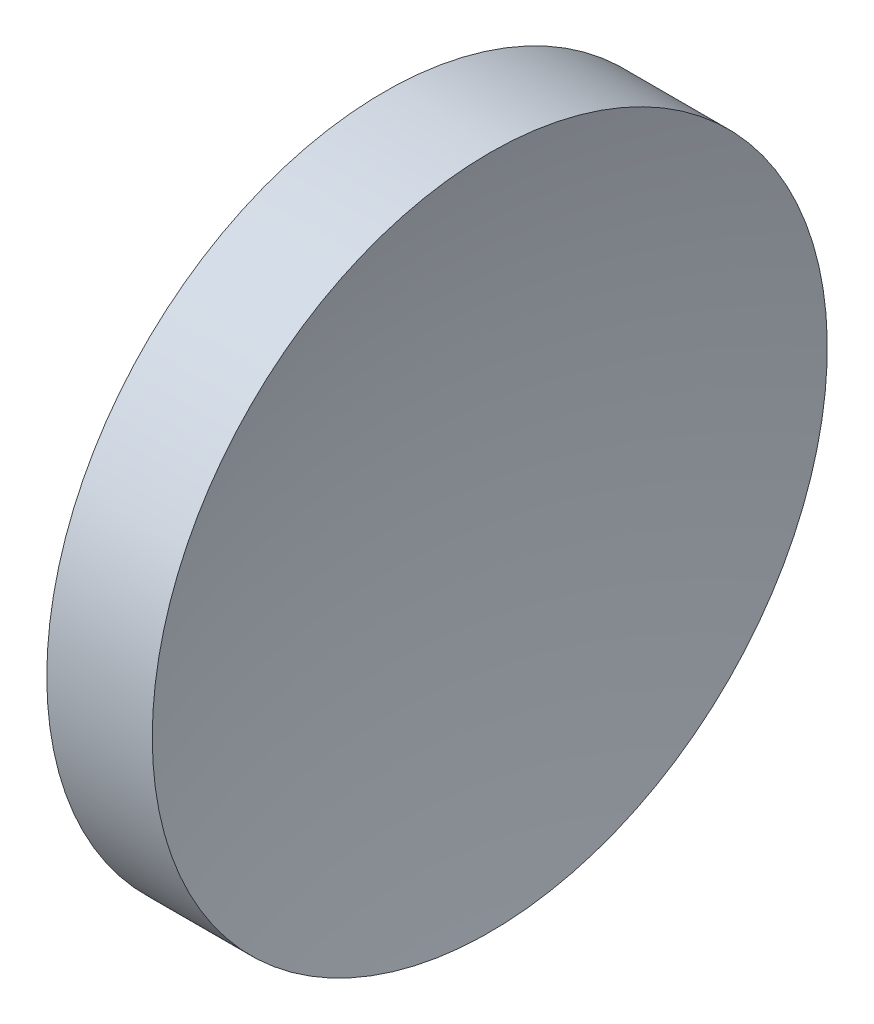
ISO-10303-21;
HEADER;
FILE_DESCRIPTION(('STEP AP214'),'2;1');
FILE_NAME('part.step','',(''),(''),'','','');
FILE_SCHEMA(('AUTOMOTIVE_DESIGN { 1 0 10303 214 1 1 1 1 }'));
ENDSEC;
DATA;
#1=APPLICATION_CONTEXT('core data for automotive mechanical design processes');
#2=APPLICATION_PROTOCOL_DEFINITION('international standard','automotive_design',2000,#1);
#3=PRODUCT_CONTEXT('',#1,'mechanical');
#4=PRODUCT('Part','Part','',(#3));
#5=PRODUCT_RELATED_PRODUCT_CATEGORY('part','',(#4));
#6=PRODUCT_DEFINITION_FORMATION('','',#4);
#7=PRODUCT_DEFINITION_CONTEXT('part definition',#1,'design');
#8=PRODUCT_DEFINITION('design','',#6,#7);
#9=PRODUCT_DEFINITION_SHAPE('','',#8);
#10=(LENGTH_UNIT() NAMED_UNIT(*) SI_UNIT(.MILLI.,.METRE.));
#11=(NAMED_UNIT(*) PLANE_ANGLE_UNIT() SI_UNIT($,.RADIAN.));
#12=(NAMED_UNIT(*) SI_UNIT($,.STERADIAN.) SOLID_ANGLE_UNIT());
#13=UNCERTAINTY_MEASURE_WITH_UNIT(LENGTH_MEASURE(1.E-05),#10,'distance_accuracy_value','');
#14=(GEOMETRIC_REPRESENTATION_CONTEXT(3) GLOBAL_UNCERTAINTY_ASSIGNED_CONTEXT((#13)) GLOBAL_UNIT_ASSIGNED_CONTEXT((#10,
#11,#12)) REPRESENTATION_CONTEXT('',''));
#15=CARTESIAN_POINT('',(0.,0.,0.));
#16=DIRECTION('',(0.,0.,1.));
#17=DIRECTION('',(1.,0.,0.));
#18=AXIS2_PLACEMENT_3D('',#15,#16,#17);
#19=CARTESIAN_POINT('',(78.319152657616,26.089041149195,0.));
#20=DIRECTION('',(-1.,0.,0.));
#21=DIRECTION('',(0.,1.,0.));
#22=AXIS2_PLACEMENT_3D('',#19,#20,#21);
#23=SPHERICAL_SURFACE('',#22,32.5);
#24=CARTESIAN_POINT('',(46.819152657616,26.089041149195,0.));
#25=DIRECTION('',(-1.,0.,0.));
#26=DIRECTION('',(0.,0.,1.));
#27=AXIS2_PLACEMENT_3D('',#24,#25,#26);
#28=CIRCLE('',#27,8.);
#29=CARTESIAN_POINT('',(46.819152657616,26.089041149195,8.));
#30=VERTEX_POINT('',#29);
#31=EDGE_CURVE('E10',#30,#30,#28,.T.);
#32=ORIENTED_EDGE('',*,*,#31,.F.);
#33=EDGE_LOOP('',(#32));
#34=FACE_BOUND('',#33,.T.);
#35=ADVANCED_FACE('F33',(#34),#23,.F.);
#36=CARTESIAN_POINT('',(42.4498611141368,26.089041149195,0.));
#37=DIRECTION('',(-1.,0.,0.));
#38=DIRECTION('',(0.,0.,1.));
#39=AXIS2_PLACEMENT_3D('',#36,#37,#38);
#40=CYLINDRICAL_SURFACE('',#39,8.);
#41=CARTESIAN_POINT('',(44.3191526931544,26.089041149195,0.));
#42=DIRECTION('',(-1.,0.,0.));
#43=DIRECTION('',(0.,0.,1.));
#44=AXIS2_PLACEMENT_3D('',#41,#42,#43);
#45=CIRCLE('',#44,8.);
#46=CARTESIAN_POINT('',(44.3191526931544,26.089041149195,8.));
#47=VERTEX_POINT('',#46);
#48=EDGE_CURVE('E39',#47,#47,#45,.T.);
#49=ORIENTED_EDGE('',*,*,#48,.F.);
#50=EDGE_LOOP('',(#49));
#51=FACE_BOUND('',#50,.T.);
#52=ORIENTED_EDGE('',*,*,#31,.T.);
#53=EDGE_LOOP('',(#52));
#54=FACE_BOUND('',#53,.T.);
#55=ADVANCED_FACE('F47',(#51,#54),#40,.T.);
#56=CARTESIAN_POINT('',(44.3191526931544,26.089041149195,0.));
#57=DIRECTION('',(1.,0.,0.));
#58=DIRECTION('',(0.,0.,-1.));
#59=AXIS2_PLACEMENT_3D('',#56,#57,#58);
#60=PLANE('',#59);
#61=ORIENTED_EDGE('',*,*,#48,.T.);
#62=EDGE_LOOP('',(#61));
#63=FACE_BOUND('',#62,.T.);
#64=ADVANCED_FACE('F45',(#63),#60,.F.);
#65=CLOSED_SHELL('',(#35,#55,#64));
#66=MANIFOLD_SOLID_BREP('B2',#65);
#67=ADVANCED_BREP_SHAPE_REPRESENTATION('',(#18,#66),#14);
#68=SHAPE_DEFINITION_REPRESENTATION(#9,#67);
ENDSEC;
END-ISO-10303-21;
